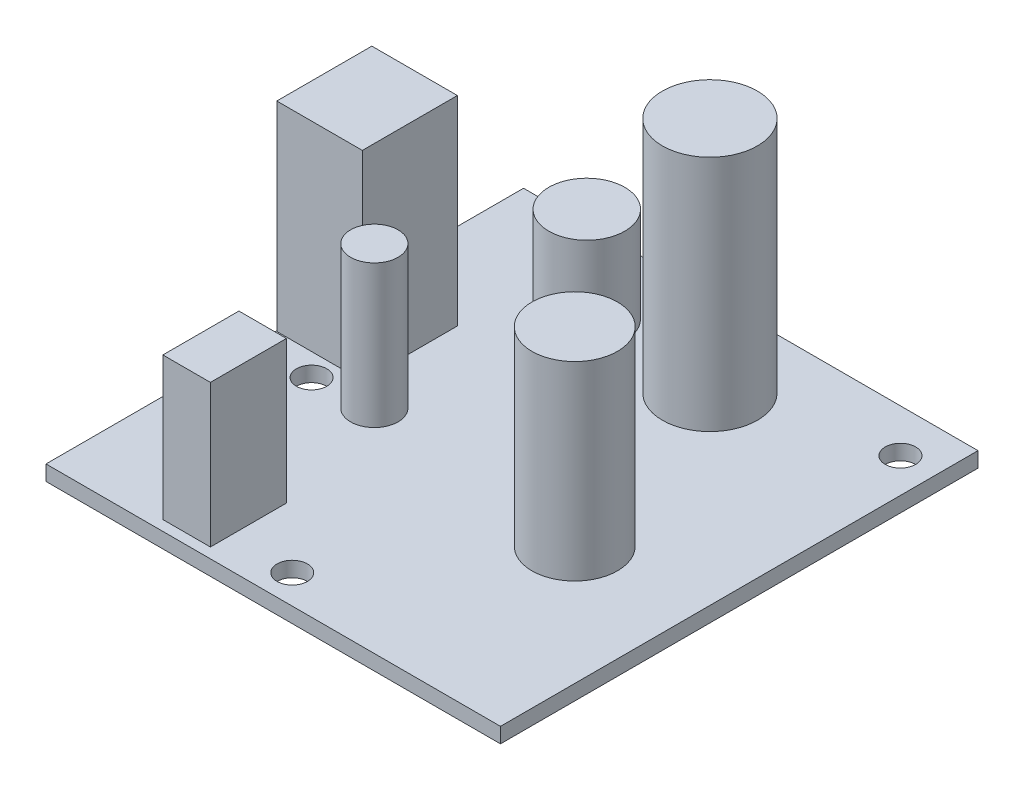
ISO-10303-21;
HEADER;
FILE_DESCRIPTION(('STEP AP214'),'2;1');
FILE_NAME('part.step','',(''),(''),'','','');
FILE_SCHEMA(('AUTOMOTIVE_DESIGN { 1 0 10303 214 1 1 1 1 }'));
ENDSEC;
DATA;
#1=APPLICATION_CONTEXT('core data for automotive mechanical design processes');
#2=APPLICATION_PROTOCOL_DEFINITION('international standard','automotive_design',2000,#1);
#3=PRODUCT_CONTEXT('',#1,'mechanical');
#4=PRODUCT('Part','Part','',(#3));
#5=PRODUCT_RELATED_PRODUCT_CATEGORY('part','',(#4));
#6=PRODUCT_DEFINITION_FORMATION('','',#4);
#7=PRODUCT_DEFINITION_CONTEXT('part definition',#1,'design');
#8=PRODUCT_DEFINITION('design','',#6,#7);
#9=PRODUCT_DEFINITION_SHAPE('','',#8);
#10=(LENGTH_UNIT() NAMED_UNIT(*) SI_UNIT(.MILLI.,.METRE.));
#11=(NAMED_UNIT(*) PLANE_ANGLE_UNIT() SI_UNIT($,.RADIAN.));
#12=(NAMED_UNIT(*) SI_UNIT($,.STERADIAN.) SOLID_ANGLE_UNIT());
#13=UNCERTAINTY_MEASURE_WITH_UNIT(LENGTH_MEASURE(1.E-05),#10,'distance_accuracy_value','');
#14=(GEOMETRIC_REPRESENTATION_CONTEXT(3) GLOBAL_UNCERTAINTY_ASSIGNED_CONTEXT((#13)) GLOBAL_UNIT_ASSIGNED_CONTEXT((#10,
#11,#12)) REPRESENTATION_CONTEXT('',''));
#15=CARTESIAN_POINT('',(0.,0.,0.));
#16=DIRECTION('',(0.,0.,1.));
#17=DIRECTION('',(1.,0.,0.));
#18=AXIS2_PLACEMENT_3D('',#15,#16,#17);
#19=CARTESIAN_POINT('',(15.24,10.,-41.656));
#20=DIRECTION('',(0.,-1.,0.));
#21=DIRECTION('',(0.,0.,-1.));
#22=AXIS2_PLACEMENT_3D('',#19,#20,#21);
#23=CYLINDRICAL_SURFACE('',#22,4.);
#24=CARTESIAN_POINT('',(15.24,10.,-41.656));
#25=DIRECTION('',(0.,1.,0.));
#26=DIRECTION('',(0.,0.,1.));
#27=AXIS2_PLACEMENT_3D('',#24,#25,#26);
#28=CIRCLE('',#27,4.);
#29=CARTESIAN_POINT('',(15.24,10.,-37.656));
#30=VERTEX_POINT('',#29);
#31=EDGE_CURVE('E11',#30,#30,#28,.T.);
#32=ORIENTED_EDGE('',*,*,#31,.F.);
#33=EDGE_LOOP('',(#32));
#34=FACE_BOUND('',#33,.T.);
#35=CARTESIAN_POINT('',(15.24,0.,-41.656));
#36=DIRECTION('',(0.,1.,0.));
#37=DIRECTION('',(0.,0.,1.));
#38=AXIS2_PLACEMENT_3D('',#35,#36,#37);
#39=CIRCLE('',#38,4.);
#40=CARTESIAN_POINT('',(15.24,0.,-37.656));
#41=VERTEX_POINT('',#40);
#42=EDGE_CURVE('E55',#41,#41,#39,.T.);
#43=ORIENTED_EDGE('',*,*,#42,.T.);
#44=EDGE_LOOP('',(#43));
#45=FACE_BOUND('',#44,.T.);
#46=ADVANCED_FACE('F52',(#34,#45),#23,.T.);
#47=CARTESIAN_POINT('',(0.,10.,0.));
#48=DIRECTION('',(0.,1.,0.));
#49=DIRECTION('',(0.,0.,1.));
#50=AXIS2_PLACEMENT_3D('',#47,#48,#49);
#51=PLANE('',#50);
#52=ORIENTED_EDGE('',*,*,#31,.T.);
#53=EDGE_LOOP('',(#52));
#54=FACE_BOUND('',#53,.T.);
#55=ADVANCED_FACE('F67',(#54),#51,.T.);
#56=CARTESIAN_POINT('',(0.,0.,0.));
#57=DIRECTION('',(0.,1.,0.));
#58=DIRECTION('',(0.,0.,1.));
#59=AXIS2_PLACEMENT_3D('',#56,#57,#58);
#60=PLANE('',#59);
#61=ORIENTED_EDGE('',*,*,#42,.F.);
#62=EDGE_LOOP('',(#61));
#63=FACE_BOUND('',#62,.T.);
#64=ADVANCED_FACE('F65',(#63),#60,.F.);
#65=CLOSED_SHELL('',(#46,#55,#64));
#66=MANIFOLD_SOLID_BREP('B2',#65);
#67=CARTESIAN_POINT('',(47.81426875,-1.6,-50.24035));
#68=DIRECTION('',(1.,0.,0.));
#69=DIRECTION('',(0.,0.,-1.));
#70=AXIS2_PLACEMENT_3D('',#67,#68,#69);
#71=PLANE('',#70);
#72=DIRECTION('',(0.,0.,-1.));
#73=VECTOR('',#72,1.);
#74=CARTESIAN_POINT('',(47.81426875,0.,-50.24035));
#75=LINE('',#74,#73);
#76=CARTESIAN_POINT('',(47.81426875,0.,0.));
#77=VERTEX_POINT('',#76);
#78=CARTESIAN_POINT('',(47.81426875,0.,-50.24035));
#79=VERTEX_POINT('',#78);
#80=EDGE_CURVE('E300',#77,#79,#75,.T.);
#81=ORIENTED_EDGE('',*,*,#80,.F.);
#82=DIRECTION('',(0.,1.,0.));
#83=VECTOR('',#82,1.);
#84=CARTESIAN_POINT('',(47.81426875,-1.6,0.));
#85=LINE('',#84,#83);
#86=CARTESIAN_POINT('',(47.81426875,-1.6,0.));
#87=VERTEX_POINT('',#86);
#88=EDGE_CURVE('E50',#87,#77,#85,.T.);
#89=ORIENTED_EDGE('',*,*,#88,.F.);
#90=DIRECTION('',(0.,0.,-1.));
#91=VECTOR('',#90,1.);
#92=CARTESIAN_POINT('',(47.81426875,-1.6,-50.24035));
#93=LINE('',#92,#91);
#94=CARTESIAN_POINT('',(47.81426875,-1.6,-50.24035));
#95=VERTEX_POINT('',#94);
#96=EDGE_CURVE('E304',#87,#95,#93,.T.);
#97=ORIENTED_EDGE('',*,*,#96,.T.);
#98=DIRECTION('',(0.,1.,0.));
#99=VECTOR('',#98,1.);
#100=CARTESIAN_POINT('',(47.81426875,-1.6,-50.24035));
#101=LINE('',#100,#99);
#102=EDGE_CURVE('E104',#95,#79,#101,.T.);
#103=ORIENTED_EDGE('',*,*,#102,.T.);
#104=EDGE_LOOP('',(#81,#89,#97,#103));
#105=FACE_BOUND('',#104,.T.);
#106=ADVANCED_FACE('F101',(#105),#71,.T.);
#107=CARTESIAN_POINT('',(47.81426875,-1.6,0.));
#108=DIRECTION('',(0.,0.,1.));
#109=DIRECTION('',(1.,0.,0.));
#110=AXIS2_PLACEMENT_3D('',#107,#108,#109);
#111=PLANE('',#110);
#112=DIRECTION('',(1.,0.,0.));
#113=VECTOR('',#112,1.);
#114=CARTESIAN_POINT('',(47.81426875,0.,0.));
#115=LINE('',#114,#113);
#116=CARTESIAN_POINT('',(0.,0.,0.));
#117=VERTEX_POINT('',#116);
#118=EDGE_CURVE('E309',#117,#77,#115,.T.);
#119=ORIENTED_EDGE('',*,*,#118,.F.);
#120=DIRECTION('',(0.,1.,0.));
#121=VECTOR('',#120,1.);
#122=CARTESIAN_POINT('',(0.,-1.6,0.));
#123=LINE('',#122,#121);
#124=CARTESIAN_POINT('',(0.,-1.6,0.));
#125=VERTEX_POINT('',#124);
#126=EDGE_CURVE('E110',#125,#117,#123,.T.);
#127=ORIENTED_EDGE('',*,*,#126,.F.);
#128=DIRECTION('',(1.,0.,0.));
#129=VECTOR('',#128,1.);
#130=CARTESIAN_POINT('',(47.81426875,-1.6,0.));
#131=LINE('',#130,#129);
#132=EDGE_CURVE('E317',#125,#87,#131,.T.);
#133=ORIENTED_EDGE('',*,*,#132,.T.);
#134=ORIENTED_EDGE('',*,*,#88,.T.);
#135=EDGE_LOOP('',(#119,#127,#133,#134));
#136=FACE_BOUND('',#135,.T.);
#137=ADVANCED_FACE('F351',(#136),#111,.T.);
#138=CARTESIAN_POINT('',(0.,-1.6,-50.24035));
#139=DIRECTION('',(-1.,0.,0.));
#140=DIRECTION('',(0.,0.,1.));
#141=AXIS2_PLACEMENT_3D('',#138,#139,#140);
#142=PLANE('',#141);
#143=DIRECTION('',(0.,0.,1.));
#144=VECTOR('',#143,1.);
#145=CARTESIAN_POINT('',(0.,0.,-50.24035));
#146=LINE('',#145,#144);
#147=CARTESIAN_POINT('',(0.,0.,-50.24035));
#148=VERTEX_POINT('',#147);
#149=EDGE_CURVE('E328',#148,#117,#146,.T.);
#150=ORIENTED_EDGE('',*,*,#149,.F.);
#151=DIRECTION('',(0.,1.,0.));
#152=VECTOR('',#151,1.);
#153=CARTESIAN_POINT('',(0.,-1.6,-50.24035));
#154=LINE('',#153,#152);
#155=CARTESIAN_POINT('',(0.,-1.6,-50.24035));
#156=VERTEX_POINT('',#155);
#157=EDGE_CURVE('E336',#156,#148,#154,.T.);
#158=ORIENTED_EDGE('',*,*,#157,.F.);
#159=DIRECTION('',(0.,0.,1.));
#160=VECTOR('',#159,1.);
#161=CARTESIAN_POINT('',(0.,-1.6,-50.24035));
#162=LINE('',#161,#160);
#163=EDGE_CURVE('E313',#156,#125,#162,.T.);
#164=ORIENTED_EDGE('',*,*,#163,.T.);
#165=ORIENTED_EDGE('',*,*,#126,.T.);
#166=EDGE_LOOP('',(#150,#158,#164,#165));
#167=FACE_BOUND('',#166,.T.);
#168=ADVANCED_FACE('F356',(#167),#142,.T.);
#169=CARTESIAN_POINT('',(47.81426875,-1.6,-50.24035));
#170=DIRECTION('',(0.,0.,-1.));
#171=DIRECTION('',(-1.,0.,0.));
#172=AXIS2_PLACEMENT_3D('',#169,#170,#171);
#173=PLANE('',#172);
#174=DIRECTION('',(-1.,0.,0.));
#175=VECTOR('',#174,1.);
#176=CARTESIAN_POINT('',(47.81426875,0.,-50.24035));
#177=LINE('',#176,#175);
#178=EDGE_CURVE('E324',#79,#148,#177,.T.);
#179=ORIENTED_EDGE('',*,*,#178,.F.);
#180=ORIENTED_EDGE('',*,*,#102,.F.);
#181=DIRECTION('',(-1.,0.,0.));
#182=VECTOR('',#181,1.);
#183=CARTESIAN_POINT('',(47.81426875,-1.6,-50.24035));
#184=LINE('',#183,#182);
#185=EDGE_CURVE('E308',#95,#156,#184,.T.);
#186=ORIENTED_EDGE('',*,*,#185,.T.);
#187=ORIENTED_EDGE('',*,*,#157,.T.);
#188=EDGE_LOOP('',(#179,#180,#186,#187));
#189=FACE_BOUND('',#188,.T.);
#190=ADVANCED_FACE('F346',(#189),#173,.T.);
#191=CARTESIAN_POINT('',(0.,-1.6,0.));
#192=DIRECTION('',(0.,-1.,0.));
#193=DIRECTION('',(0.,0.,-1.));
#194=AXIS2_PLACEMENT_3D('',#191,#192,#193);
#195=PLANE('',#194);
#196=CARTESIAN_POINT('',(22.86,-1.6,-3.04800000000001));
#197=DIRECTION('',(0.,1.,0.));
#198=DIRECTION('',(0.,0.,1.));
#199=AXIS2_PLACEMENT_3D('',#196,#197,#198);
#200=CIRCLE('',#199,1.6);
#201=CARTESIAN_POINT('',(22.86,-1.6,-1.448));
#202=VERTEX_POINT('',#201);
#203=EDGE_CURVE('E552',#202,#202,#200,.T.);
#204=ORIENTED_EDGE('',*,*,#203,.T.);
#205=EDGE_LOOP('',(#204));
#206=FACE_BOUND('',#205,.T.);
#207=CARTESIAN_POINT('',(44.196,-1.6,-45.7));
#208=DIRECTION('',(0.,1.,0.));
#209=DIRECTION('',(0.,0.,1.));
#210=AXIS2_PLACEMENT_3D('',#207,#208,#209);
#211=CIRCLE('',#210,1.6);
#212=CARTESIAN_POINT('',(44.196,-1.6,-44.1));
#213=VERTEX_POINT('',#212);
#214=EDGE_CURVE('E562',#213,#213,#211,.T.);
#215=ORIENTED_EDGE('',*,*,#214,.T.);
#216=EDGE_LOOP('',(#215));
#217=FACE_BOUND('',#216,.T.);
#218=CARTESIAN_POINT('',(6.096,-1.6,-21.844));
#219=DIRECTION('',(0.,1.,0.));
#220=DIRECTION('',(0.,0.,1.));
#221=AXIS2_PLACEMENT_3D('',#218,#219,#220);
#222=CIRCLE('',#221,1.6);
#223=CARTESIAN_POINT('',(6.096,-1.6,-20.244));
#224=VERTEX_POINT('',#223);
#225=EDGE_CURVE('E570',#224,#224,#222,.T.);
#226=ORIENTED_EDGE('',*,*,#225,.T.);
#227=EDGE_LOOP('',(#226));
#228=FACE_BOUND('',#227,.T.);
#229=CARTESIAN_POINT('',(15.24,-1.6,-41.656));
#230=DIRECTION('',(0.,1.,0.));
#231=DIRECTION('',(0.,0.,1.));
#232=AXIS2_PLACEMENT_3D('',#229,#230,#231);
#233=CIRCLE('',#232,4.);
#234=CARTESIAN_POINT('',(15.24,-1.6,-37.656));
#235=VERTEX_POINT('',#234);
#236=EDGE_CURVE('E578',#235,#235,#233,.T.);
#237=ORIENTED_EDGE('',*,*,#236,.T.);
#238=EDGE_LOOP('',(#237));
#239=FACE_BOUND('',#238,.T.);
#240=CARTESIAN_POINT('',(12.192,-1.6,-22.352));
#241=DIRECTION('',(0.,1.,0.));
#242=DIRECTION('',(0.,0.,1.));
#243=AXIS2_PLACEMENT_3D('',#240,#241,#242);
#244=CIRCLE('',#243,2.5);
#245=CARTESIAN_POINT('',(12.192,-1.6,-19.852));
#246=VERTEX_POINT('',#245);
#247=EDGE_CURVE('E229',#246,#246,#244,.T.);
#248=ORIENTED_EDGE('',*,*,#247,.T.);
#249=EDGE_LOOP('',(#248));
#250=FACE_BOUND('',#249,.T.);
#251=DIRECTION('',(0.,0.,-1.));
#252=VECTOR('',#251,1.);
#253=CARTESIAN_POINT('',(16.216,-1.6,-1.08));
#254=LINE('',#253,#252);
#255=CARTESIAN_POINT('',(16.216,-1.6,-1.08));
#256=VERTEX_POINT('',#255);
#257=CARTESIAN_POINT('',(16.216,-1.6,-9.08));
#258=VERTEX_POINT('',#257);
#259=EDGE_CURVE('E193',#256,#258,#254,.T.);
#260=ORIENTED_EDGE('',*,*,#259,.T.);
#261=DIRECTION('',(-1.,0.,0.));
#262=VECTOR('',#261,1.);
#263=CARTESIAN_POINT('',(11.216,-1.6,-9.08));
#264=LINE('',#263,#262);
#265=CARTESIAN_POINT('',(11.216,-1.6,-9.08));
#266=VERTEX_POINT('',#265);
#267=EDGE_CURVE('E203',#258,#266,#264,.T.);
#268=ORIENTED_EDGE('',*,*,#267,.T.);
#269=DIRECTION('',(0.,0.,1.));
#270=VECTOR('',#269,1.);
#271=CARTESIAN_POINT('',(11.216,-1.6,-1.08));
#272=LINE('',#271,#270);
#273=CARTESIAN_POINT('',(11.216,-1.6,-1.08));
#274=VERTEX_POINT('',#273);
#275=EDGE_CURVE('E118',#266,#274,#272,.T.);
#276=ORIENTED_EDGE('',*,*,#275,.T.);
#277=DIRECTION('',(1.,0.,0.));
#278=VECTOR('',#277,1.);
#279=CARTESIAN_POINT('',(11.216,-1.6,-1.08));
#280=LINE('',#279,#278);
#281=EDGE_CURVE('E200',#274,#256,#280,.T.);
#282=ORIENTED_EDGE('',*,*,#281,.T.);
#283=EDGE_LOOP('',(#260,#268,#276,#282));
#284=FACE_BOUND('',#283,.T.);
#285=CARTESIAN_POINT('',(35.306,-1.6,-20.32));
#286=DIRECTION('',(0.,1.,0.));
#287=DIRECTION('',(0.,0.,1.));
#288=AXIS2_PLACEMENT_3D('',#285,#286,#287);
#289=CIRCLE('',#288,4.5);
#290=CARTESIAN_POINT('',(35.306,-1.6,-15.82));
#291=VERTEX_POINT('',#290);
#292=EDGE_CURVE('E244',#291,#291,#289,.T.);
#293=ORIENTED_EDGE('',*,*,#292,.T.);
#294=EDGE_LOOP('',(#293));
#295=FACE_BOUND('',#294,.T.);
#296=DIRECTION('',(0.,0.,-1.));
#297=VECTOR('',#296,1.);
#298=CARTESIAN_POINT('',(9.07199999999998,-1.6,-34.21));
#299=LINE('',#298,#297);
#300=CARTESIAN_POINT('',(9.07199999999998,-1.6,-24.21));
#301=VERTEX_POINT('',#300);
#302=CARTESIAN_POINT('',(9.07199999999998,-1.6,-34.21));
#303=VERTEX_POINT('',#302);
#304=EDGE_CURVE('E252',#301,#303,#299,.T.);
#305=ORIENTED_EDGE('',*,*,#304,.T.);
#306=DIRECTION('',(-1.,0.,0.));
#307=VECTOR('',#306,1.);
#308=CARTESIAN_POINT('',(0.0719999999999818,-1.6,-34.21));
#309=LINE('',#308,#307);
#310=CARTESIAN_POINT('',(0.0719999999999818,-1.6,-34.21));
#311=VERTEX_POINT('',#310);
#312=EDGE_CURVE('E256',#303,#311,#309,.T.);
#313=ORIENTED_EDGE('',*,*,#312,.T.);
#314=DIRECTION('',(0.,0.,1.));
#315=VECTOR('',#314,1.);
#316=CARTESIAN_POINT('',(0.0719999999999818,-1.6,-34.21));
#317=LINE('',#316,#315);
#318=CARTESIAN_POINT('',(0.0719999999999818,-1.6,-24.21));
#319=VERTEX_POINT('',#318);
#320=EDGE_CURVE('E261',#311,#319,#317,.T.);
#321=ORIENTED_EDGE('',*,*,#320,.T.);
#322=DIRECTION('',(1.,0.,0.));
#323=VECTOR('',#322,1.);
#324=CARTESIAN_POINT('',(0.0719999999999818,-1.6,-24.21));
#325=LINE('',#324,#323);
#326=EDGE_CURVE('E265',#319,#301,#325,.T.);
#327=ORIENTED_EDGE('',*,*,#326,.T.);
#328=EDGE_LOOP('',(#305,#313,#321,#327));
#329=FACE_BOUND('',#328,.T.);
#330=CARTESIAN_POINT('',(28.448,-1.6,-41.402));
#331=DIRECTION('',(0.,1.,0.));
#332=DIRECTION('',(0.,0.,1.));
#333=AXIS2_PLACEMENT_3D('',#330,#331,#332);
#334=CIRCLE('',#333,5.00000000000001);
#335=CARTESIAN_POINT('',(28.448,-1.6,-36.402));
#336=VERTEX_POINT('',#335);
#337=EDGE_CURVE('E296',#336,#336,#334,.T.);
#338=ORIENTED_EDGE('',*,*,#337,.T.);
#339=EDGE_LOOP('',(#338));
#340=FACE_BOUND('',#339,.T.);
#341=ORIENTED_EDGE('',*,*,#96,.F.);
#342=ORIENTED_EDGE('',*,*,#132,.F.);
#343=ORIENTED_EDGE('',*,*,#163,.F.);
#344=ORIENTED_EDGE('',*,*,#185,.F.);
#345=EDGE_LOOP('',(#341,#342,#343,#344));
#346=FACE_BOUND('',#345,.T.);
#347=ADVANCED_FACE('F208',(#206,#217,#228,#239,#250,#284,#295,#329,#340,#346),#195,.T.);
#348=CARTESIAN_POINT('',(0.,0.,0.));
#349=DIRECTION('',(0.,-1.,0.));
#350=DIRECTION('',(0.,0.,-1.));
#351=AXIS2_PLACEMENT_3D('',#348,#349,#350);
#352=PLANE('',#351);
#353=CARTESIAN_POINT('',(22.86,0.,-3.04800000000001));
#354=DIRECTION('',(0.,1.,0.));
#355=DIRECTION('',(0.,0.,1.));
#356=AXIS2_PLACEMENT_3D('',#353,#354,#355);
#357=CIRCLE('',#356,1.6);
#358=CARTESIAN_POINT('',(22.86,0.,-1.448));
#359=VERTEX_POINT('',#358);
#360=EDGE_CURVE('E555',#359,#359,#357,.T.);
#361=ORIENTED_EDGE('',*,*,#360,.F.);
#362=EDGE_LOOP('',(#361));
#363=FACE_BOUND('',#362,.T.);
#364=CARTESIAN_POINT('',(44.196,0.,-45.7));
#365=DIRECTION('',(0.,1.,0.));
#366=DIRECTION('',(0.,0.,1.));
#367=AXIS2_PLACEMENT_3D('',#364,#365,#366);
#368=CIRCLE('',#367,1.6);
#369=CARTESIAN_POINT('',(44.196,0.,-44.1));
#370=VERTEX_POINT('',#369);
#371=EDGE_CURVE('E559',#370,#370,#368,.T.);
#372=ORIENTED_EDGE('',*,*,#371,.F.);
#373=EDGE_LOOP('',(#372));
#374=FACE_BOUND('',#373,.T.);
#375=CARTESIAN_POINT('',(6.096,0.,-21.844));
#376=DIRECTION('',(0.,1.,0.));
#377=DIRECTION('',(0.,0.,1.));
#378=AXIS2_PLACEMENT_3D('',#375,#376,#377);
#379=CIRCLE('',#378,1.6);
#380=CARTESIAN_POINT('',(6.096,0.,-20.244));
#381=VERTEX_POINT('',#380);
#382=EDGE_CURVE('E566',#381,#381,#379,.T.);
#383=ORIENTED_EDGE('',*,*,#382,.F.);
#384=EDGE_LOOP('',(#383));
#385=FACE_BOUND('',#384,.T.);
#386=CARTESIAN_POINT('',(15.24,0.,-41.656));
#387=DIRECTION('',(0.,1.,0.));
#388=DIRECTION('',(0.,0.,1.));
#389=AXIS2_PLACEMENT_3D('',#386,#387,#388);
#390=CIRCLE('',#389,4.);
#391=CARTESIAN_POINT('',(15.24,0.,-37.656));
#392=VERTEX_POINT('',#391);
#393=EDGE_CURVE('E574',#392,#392,#390,.T.);
#394=ORIENTED_EDGE('',*,*,#393,.F.);
#395=EDGE_LOOP('',(#394));
#396=FACE_BOUND('',#395,.T.);
#397=CARTESIAN_POINT('',(12.192,0.,-22.352));
#398=DIRECTION('',(0.,1.,0.));
#399=DIRECTION('',(0.,0.,1.));
#400=AXIS2_PLACEMENT_3D('',#397,#398,#399);
#401=CIRCLE('',#400,2.5);
#402=CARTESIAN_POINT('',(12.192,0.,-19.852));
#403=VERTEX_POINT('',#402);
#404=EDGE_CURVE('E219',#403,#403,#401,.T.);
#405=ORIENTED_EDGE('',*,*,#404,.F.);
#406=EDGE_LOOP('',(#405));
#407=FACE_BOUND('',#406,.T.);
#408=DIRECTION('',(-1.,0.,0.));
#409=VECTOR('',#408,1.);
#410=CARTESIAN_POINT('',(11.216,0.,-9.08));
#411=LINE('',#410,#409);
#412=CARTESIAN_POINT('',(16.216,0.,-9.08));
#413=VERTEX_POINT('',#412);
#414=CARTESIAN_POINT('',(11.216,0.,-9.08));
#415=VERTEX_POINT('',#414);
#416=EDGE_CURVE('E228',#413,#415,#411,.T.);
#417=ORIENTED_EDGE('',*,*,#416,.F.);
#418=DIRECTION('',(0.,0.,-1.));
#419=VECTOR('',#418,1.);
#420=CARTESIAN_POINT('',(16.216,0.,-1.08));
#421=LINE('',#420,#419);
#422=CARTESIAN_POINT('',(16.216,0.,-1.08));
#423=VERTEX_POINT('',#422);
#424=EDGE_CURVE('E126',#423,#413,#421,.T.);
#425=ORIENTED_EDGE('',*,*,#424,.F.);
#426=DIRECTION('',(1.,0.,0.));
#427=VECTOR('',#426,1.);
#428=CARTESIAN_POINT('',(11.216,0.,-1.08));
#429=LINE('',#428,#427);
#430=CARTESIAN_POINT('',(11.216,0.,-1.08));
#431=VERTEX_POINT('',#430);
#432=EDGE_CURVE('E212',#431,#423,#429,.T.);
#433=ORIENTED_EDGE('',*,*,#432,.F.);
#434=DIRECTION('',(0.,0.,1.));
#435=VECTOR('',#434,1.);
#436=CARTESIAN_POINT('',(11.216,0.,-1.08));
#437=LINE('',#436,#435);
#438=EDGE_CURVE('E216',#415,#431,#437,.T.);
#439=ORIENTED_EDGE('',*,*,#438,.F.);
#440=EDGE_LOOP('',(#417,#425,#433,#439));
#441=FACE_BOUND('',#440,.T.);
#442=CARTESIAN_POINT('',(35.306,0.,-20.32));
#443=DIRECTION('',(0.,1.,0.));
#444=DIRECTION('',(0.,0.,1.));
#445=AXIS2_PLACEMENT_3D('',#442,#443,#444);
#446=CIRCLE('',#445,4.5);
#447=CARTESIAN_POINT('',(35.306,0.,-15.82));
#448=VERTEX_POINT('',#447);
#449=EDGE_CURVE('E238',#448,#448,#446,.T.);
#450=ORIENTED_EDGE('',*,*,#449,.F.);
#451=EDGE_LOOP('',(#450));
#452=FACE_BOUND('',#451,.T.);
#453=DIRECTION('',(-1.,0.,0.));
#454=VECTOR('',#453,1.);
#455=CARTESIAN_POINT('',(0.0719999999999818,0.,-34.21));
#456=LINE('',#455,#454);
#457=CARTESIAN_POINT('',(9.07199999999998,0.,-34.21));
#458=VERTEX_POINT('',#457);
#459=CARTESIAN_POINT('',(0.0719999999999818,0.,-34.21));
#460=VERTEX_POINT('',#459);
#461=EDGE_CURVE('E272',#458,#460,#456,.T.);
#462=ORIENTED_EDGE('',*,*,#461,.F.);
#463=DIRECTION('',(0.,0.,-1.));
#464=VECTOR('',#463,1.);
#465=CARTESIAN_POINT('',(9.07199999999998,0.,-34.21));
#466=LINE('',#465,#464);
#467=CARTESIAN_POINT('',(9.07199999999998,0.,-24.21));
#468=VERTEX_POINT('',#467);
#469=EDGE_CURVE('E248',#468,#458,#466,.T.);
#470=ORIENTED_EDGE('',*,*,#469,.F.);
#471=DIRECTION('',(1.,0.,0.));
#472=VECTOR('',#471,1.);
#473=CARTESIAN_POINT('',(0.0719999999999818,0.,-24.21));
#474=LINE('',#473,#472);
#475=CARTESIAN_POINT('',(0.0719999999999818,0.,-24.21));
#476=VERTEX_POINT('',#475);
#477=EDGE_CURVE('E257',#476,#468,#474,.T.);
#478=ORIENTED_EDGE('',*,*,#477,.F.);
#479=DIRECTION('',(0.,0.,1.));
#480=VECTOR('',#479,1.);
#481=CARTESIAN_POINT('',(0.0719999999999818,0.,-34.21));
#482=LINE('',#481,#480);
#483=EDGE_CURVE('E276',#460,#476,#482,.T.);
#484=ORIENTED_EDGE('',*,*,#483,.F.);
#485=EDGE_LOOP('',(#462,#470,#478,#484));
#486=FACE_BOUND('',#485,.T.);
#487=CARTESIAN_POINT('',(28.448,0.,-41.402));
#488=DIRECTION('',(0.,1.,0.));
#489=DIRECTION('',(0.,0.,1.));
#490=AXIS2_PLACEMENT_3D('',#487,#488,#489);
#491=CIRCLE('',#490,5.00000000000001);
#492=CARTESIAN_POINT('',(28.448,0.,-36.402));
#493=VERTEX_POINT('',#492);
#494=EDGE_CURVE('E286',#493,#493,#491,.T.);
#495=ORIENTED_EDGE('',*,*,#494,.F.);
#496=EDGE_LOOP('',(#495));
#497=FACE_BOUND('',#496,.T.);
#498=ORIENTED_EDGE('',*,*,#80,.T.);
#499=ORIENTED_EDGE('',*,*,#178,.T.);
#500=ORIENTED_EDGE('',*,*,#149,.T.);
#501=ORIENTED_EDGE('',*,*,#118,.T.);
#502=EDGE_LOOP('',(#498,#499,#500,#501));
#503=FACE_BOUND('',#502,.T.);
#504=ADVANCED_FACE('F348',(#363,#374,#385,#396,#407,#441,#452,#486,#497,#503),#352,.F.);
#505=CARTESIAN_POINT('',(28.448,-1.6,-41.402));
#506=DIRECTION('',(0.,1.,0.));
#507=DIRECTION('',(0.,0.,1.));
#508=AXIS2_PLACEMENT_3D('',#505,#506,#507);
#509=CYLINDRICAL_SURFACE('',#508,5.00000000000001);
#510=ORIENTED_EDGE('',*,*,#337,.F.);
#511=EDGE_LOOP('',(#510));
#512=FACE_BOUND('',#511,.T.);
#513=ORIENTED_EDGE('',*,*,#494,.T.);
#514=EDGE_LOOP('',(#513));
#515=FACE_BOUND('',#514,.T.);
#516=ADVANCED_FACE('F400',(#512,#515),#509,.F.);
#517=CARTESIAN_POINT('',(9.07199999999998,-1.6,-34.21));
#518=DIRECTION('',(1.,0.,0.));
#519=DIRECTION('',(0.,0.,-1.));
#520=AXIS2_PLACEMENT_3D('',#517,#518,#519);
#521=PLANE('',#520);
#522=ORIENTED_EDGE('',*,*,#469,.T.);
#523=DIRECTION('',(0.,1.,0.));
#524=VECTOR('',#523,1.);
#525=CARTESIAN_POINT('',(9.07199999999998,-1.6,-34.21));
#526=LINE('',#525,#524);
#527=EDGE_CURVE('E269',#303,#458,#526,.T.);
#528=ORIENTED_EDGE('',*,*,#527,.F.);
#529=ORIENTED_EDGE('',*,*,#304,.F.);
#530=DIRECTION('',(0.,1.,0.));
#531=VECTOR('',#530,1.);
#532=CARTESIAN_POINT('',(9.07199999999998,-1.6,-24.21));
#533=LINE('',#532,#531);
#534=EDGE_CURVE('E283',#301,#468,#533,.T.);
#535=ORIENTED_EDGE('',*,*,#534,.T.);
#536=EDGE_LOOP('',(#522,#528,#529,#535));
#537=FACE_BOUND('',#536,.T.);
#538=ADVANCED_FACE('F410',(#537),#521,.F.);
#539=CARTESIAN_POINT('',(0.0719999999999818,-1.6,-24.21));
#540=DIRECTION('',(0.,0.,1.));
#541=DIRECTION('',(1.,0.,0.));
#542=AXIS2_PLACEMENT_3D('',#539,#540,#541);
#543=PLANE('',#542);
#544=ORIENTED_EDGE('',*,*,#477,.T.);
#545=ORIENTED_EDGE('',*,*,#534,.F.);
#546=ORIENTED_EDGE('',*,*,#326,.F.);
#547=DIRECTION('',(0.,1.,0.));
#548=VECTOR('',#547,1.);
#549=CARTESIAN_POINT('',(0.0719999999999818,-1.6,-24.21));
#550=LINE('',#549,#548);
#551=EDGE_CURVE('E287',#319,#476,#550,.T.);
#552=ORIENTED_EDGE('',*,*,#551,.T.);
#553=EDGE_LOOP('',(#544,#545,#546,#552));
#554=FACE_BOUND('',#553,.T.);
#555=ADVANCED_FACE('F420',(#554),#543,.F.);
#556=CARTESIAN_POINT('',(0.0719999999999818,-1.6,-34.21));
#557=DIRECTION('',(-1.,0.,0.));
#558=DIRECTION('',(0.,0.,1.));
#559=AXIS2_PLACEMENT_3D('',#556,#557,#558);
#560=PLANE('',#559);
#561=ORIENTED_EDGE('',*,*,#483,.T.);
#562=ORIENTED_EDGE('',*,*,#551,.F.);
#563=ORIENTED_EDGE('',*,*,#320,.F.);
#564=DIRECTION('',(0.,1.,0.));
#565=VECTOR('',#564,1.);
#566=CARTESIAN_POINT('',(0.0719999999999818,-1.6,-34.21));
#567=LINE('',#566,#565);
#568=EDGE_CURVE('E290',#311,#460,#567,.T.);
#569=ORIENTED_EDGE('',*,*,#568,.T.);
#570=EDGE_LOOP('',(#561,#562,#563,#569));
#571=FACE_BOUND('',#570,.T.);
#572=ADVANCED_FACE('F430',(#571),#560,.F.);
#573=CARTESIAN_POINT('',(0.0719999999999818,-1.6,-34.21));
#574=DIRECTION('',(0.,0.,-1.));
#575=DIRECTION('',(-1.,0.,0.));
#576=AXIS2_PLACEMENT_3D('',#573,#574,#575);
#577=PLANE('',#576);
#578=ORIENTED_EDGE('',*,*,#461,.T.);
#579=ORIENTED_EDGE('',*,*,#568,.F.);
#580=ORIENTED_EDGE('',*,*,#312,.F.);
#581=ORIENTED_EDGE('',*,*,#527,.T.);
#582=EDGE_LOOP('',(#578,#579,#580,#581));
#583=FACE_BOUND('',#582,.T.);
#584=ADVANCED_FACE('F440',(#583),#577,.F.);
#585=CARTESIAN_POINT('',(35.306,-1.6,-20.32));
#586=DIRECTION('',(0.,1.,0.));
#587=DIRECTION('',(0.,0.,1.));
#588=AXIS2_PLACEMENT_3D('',#585,#586,#587);
#589=CYLINDRICAL_SURFACE('',#588,4.5);
#590=ORIENTED_EDGE('',*,*,#292,.F.);
#591=EDGE_LOOP('',(#590));
#592=FACE_BOUND('',#591,.T.);
#593=ORIENTED_EDGE('',*,*,#449,.T.);
#594=EDGE_LOOP('',(#593));
#595=FACE_BOUND('',#594,.T.);
#596=ADVANCED_FACE('F450',(#592,#595),#589,.F.);
#597=CARTESIAN_POINT('',(16.216,-1.6,-1.08));
#598=DIRECTION('',(1.,0.,0.));
#599=DIRECTION('',(0.,0.,-1.));
#600=AXIS2_PLACEMENT_3D('',#597,#598,#599);
#601=PLANE('',#600);
#602=ORIENTED_EDGE('',*,*,#424,.T.);
#603=DIRECTION('',(0.,1.,0.));
#604=VECTOR('',#603,1.);
#605=CARTESIAN_POINT('',(16.216,-1.6,-9.08));
#606=LINE('',#605,#604);
#607=EDGE_CURVE('E189',#258,#413,#606,.T.);
#608=ORIENTED_EDGE('',*,*,#607,.F.);
#609=ORIENTED_EDGE('',*,*,#259,.F.);
#610=DIRECTION('',(0.,1.,0.));
#611=VECTOR('',#610,1.);
#612=CARTESIAN_POINT('',(16.216,-1.6,-1.08));
#613=LINE('',#612,#611);
#614=EDGE_CURVE('E235',#256,#423,#613,.T.);
#615=ORIENTED_EDGE('',*,*,#614,.T.);
#616=EDGE_LOOP('',(#602,#608,#609,#615));
#617=FACE_BOUND('',#616,.T.);
#618=ADVANCED_FACE('F191',(#617),#601,.F.);
#619=CARTESIAN_POINT('',(11.216,-1.6,-1.08));
#620=DIRECTION('',(0.,0.,1.));
#621=DIRECTION('',(1.,0.,0.));
#622=AXIS2_PLACEMENT_3D('',#619,#620,#621);
#623=PLANE('',#622);
#624=ORIENTED_EDGE('',*,*,#432,.T.);
#625=ORIENTED_EDGE('',*,*,#614,.F.);
#626=ORIENTED_EDGE('',*,*,#281,.F.);
#627=DIRECTION('',(0.,1.,0.));
#628=VECTOR('',#627,1.);
#629=CARTESIAN_POINT('',(11.216,-1.6,-1.08));
#630=LINE('',#629,#628);
#631=EDGE_CURVE('E239',#274,#431,#630,.T.);
#632=ORIENTED_EDGE('',*,*,#631,.T.);
#633=EDGE_LOOP('',(#624,#625,#626,#632));
#634=FACE_BOUND('',#633,.T.);
#635=ADVANCED_FACE('F469',(#634),#623,.F.);
#636=CARTESIAN_POINT('',(11.216,-1.6,-1.08));
#637=DIRECTION('',(-1.,0.,0.));
#638=DIRECTION('',(0.,0.,1.));
#639=AXIS2_PLACEMENT_3D('',#636,#637,#638);
#640=PLANE('',#639);
#641=ORIENTED_EDGE('',*,*,#438,.T.);
#642=ORIENTED_EDGE('',*,*,#631,.F.);
#643=ORIENTED_EDGE('',*,*,#275,.F.);
#644=DIRECTION('',(0.,1.,0.));
#645=VECTOR('',#644,1.);
#646=CARTESIAN_POINT('',(11.216,-1.6,-9.08));
#647=LINE('',#646,#645);
#648=EDGE_CURVE('E199',#266,#415,#647,.T.);
#649=ORIENTED_EDGE('',*,*,#648,.T.);
#650=EDGE_LOOP('',(#641,#642,#643,#649));
#651=FACE_BOUND('',#650,.T.);
#652=ADVANCED_FACE('F478',(#651),#640,.F.);
#653=CARTESIAN_POINT('',(11.216,-1.6,-9.08));
#654=DIRECTION('',(0.,0.,-1.));
#655=DIRECTION('',(-1.,0.,0.));
#656=AXIS2_PLACEMENT_3D('',#653,#654,#655);
#657=PLANE('',#656);
#658=ORIENTED_EDGE('',*,*,#416,.T.);
#659=ORIENTED_EDGE('',*,*,#648,.F.);
#660=ORIENTED_EDGE('',*,*,#267,.F.);
#661=ORIENTED_EDGE('',*,*,#607,.T.);
#662=EDGE_LOOP('',(#658,#659,#660,#661));
#663=FACE_BOUND('',#662,.T.);
#664=ADVANCED_FACE('F204',(#663),#657,.F.);
#665=CARTESIAN_POINT('',(12.192,-1.6,-22.352));
#666=DIRECTION('',(0.,1.,0.));
#667=DIRECTION('',(0.,0.,1.));
#668=AXIS2_PLACEMENT_3D('',#665,#666,#667);
#669=CYLINDRICAL_SURFACE('',#668,2.5);
#670=ORIENTED_EDGE('',*,*,#247,.F.);
#671=EDGE_LOOP('',(#670));
#672=FACE_BOUND('',#671,.T.);
#673=ORIENTED_EDGE('',*,*,#404,.T.);
#674=EDGE_LOOP('',(#673));
#675=FACE_BOUND('',#674,.T.);
#676=ADVANCED_FACE('F496',(#672,#675),#669,.F.);
#677=CARTESIAN_POINT('',(15.24,-1.6,-41.656));
#678=DIRECTION('',(0.,1.,0.));
#679=DIRECTION('',(0.,0.,1.));
#680=AXIS2_PLACEMENT_3D('',#677,#678,#679);
#681=CYLINDRICAL_SURFACE('',#680,4.);
#682=ORIENTED_EDGE('',*,*,#236,.F.);
#683=EDGE_LOOP('',(#682));
#684=FACE_BOUND('',#683,.T.);
#685=ORIENTED_EDGE('',*,*,#393,.T.);
#686=EDGE_LOOP('',(#685));
#687=FACE_BOUND('',#686,.T.);
#688=ADVANCED_FACE('F505',(#684,#687),#681,.F.);
#689=CARTESIAN_POINT('',(6.096,-1.6,-21.844));
#690=DIRECTION('',(0.,1.,0.));
#691=DIRECTION('',(0.,0.,1.));
#692=AXIS2_PLACEMENT_3D('',#689,#690,#691);
#693=CYLINDRICAL_SURFACE('',#692,1.6);
#694=ORIENTED_EDGE('',*,*,#225,.F.);
#695=EDGE_LOOP('',(#694));
#696=FACE_BOUND('',#695,.T.);
#697=ORIENTED_EDGE('',*,*,#382,.T.);
#698=EDGE_LOOP('',(#697));
#699=FACE_BOUND('',#698,.T.);
#700=ADVANCED_FACE('F515',(#696,#699),#693,.F.);
#701=CARTESIAN_POINT('',(44.196,-1.6,-45.7));
#702=DIRECTION('',(0.,1.,0.));
#703=DIRECTION('',(0.,0.,1.));
#704=AXIS2_PLACEMENT_3D('',#701,#702,#703);
#705=CYLINDRICAL_SURFACE('',#704,1.6);
#706=ORIENTED_EDGE('',*,*,#214,.F.);
#707=EDGE_LOOP('',(#706));
#708=FACE_BOUND('',#707,.T.);
#709=ORIENTED_EDGE('',*,*,#371,.T.);
#710=EDGE_LOOP('',(#709));
#711=FACE_BOUND('',#710,.T.);
#712=ADVANCED_FACE('F525',(#708,#711),#705,.F.);
#713=CARTESIAN_POINT('',(22.86,-1.6,-3.04800000000001));
#714=DIRECTION('',(0.,1.,0.));
#715=DIRECTION('',(0.,0.,1.));
#716=AXIS2_PLACEMENT_3D('',#713,#714,#715);
#717=CYLINDRICAL_SURFACE('',#716,1.6);
#718=ORIENTED_EDGE('',*,*,#203,.F.);
#719=EDGE_LOOP('',(#718));
#720=FACE_BOUND('',#719,.T.);
#721=ORIENTED_EDGE('',*,*,#360,.T.);
#722=EDGE_LOOP('',(#721));
#723=FACE_BOUND('',#722,.T.);
#724=ADVANCED_FACE('F535',(#720,#723),#717,.F.);
#725=CLOSED_SHELL('',(#106,#137,#168,#190,#347,#504,#516,#538,#555,#572,#584,#596,#618,#635,
#652,#664,#676,#688,#700,#712,#724));
#726=MANIFOLD_SOLID_BREP('B6',#725);
#727=CARTESIAN_POINT('',(12.192,15.,-22.352));
#728=DIRECTION('',(0.,-1.,0.));
#729=DIRECTION('',(0.,0.,-1.));
#730=AXIS2_PLACEMENT_3D('',#727,#728,#729);
#731=CYLINDRICAL_SURFACE('',#730,2.5);
#732=CARTESIAN_POINT('',(12.192,15.,-22.352));
#733=DIRECTION('',(0.,1.,0.));
#734=DIRECTION('',(0.,0.,1.));
#735=AXIS2_PLACEMENT_3D('',#732,#733,#734);
#736=CIRCLE('',#735,2.5);
#737=CARTESIAN_POINT('',(12.192,15.,-19.852));
#738=VERTEX_POINT('',#737);
#739=EDGE_CURVE('E100',#738,#738,#736,.T.);
#740=ORIENTED_EDGE('',*,*,#739,.F.);
#741=EDGE_LOOP('',(#740));
#742=FACE_BOUND('',#741,.T.);
#743=CARTESIAN_POINT('',(12.192,0.,-22.352));
#744=DIRECTION('',(0.,1.,0.));
#745=DIRECTION('',(0.,0.,1.));
#746=AXIS2_PLACEMENT_3D('',#743,#744,#745);
#747=CIRCLE('',#746,2.5);
#748=CARTESIAN_POINT('',(12.192,0.,-19.852));
#749=VERTEX_POINT('',#748);
#750=EDGE_CURVE('E649',#749,#749,#747,.T.);
#751=ORIENTED_EDGE('',*,*,#750,.T.);
#752=EDGE_LOOP('',(#751));
#753=FACE_BOUND('',#752,.T.);
#754=ADVANCED_FACE('F646',(#742,#753),#731,.T.);
#755=CARTESIAN_POINT('',(0.,15.,0.));
#756=DIRECTION('',(0.,1.,0.));
#757=DIRECTION('',(0.,0.,1.));
#758=AXIS2_PLACEMENT_3D('',#755,#756,#757);
#759=PLANE('',#758);
#760=ORIENTED_EDGE('',*,*,#739,.T.);
#761=EDGE_LOOP('',(#760));
#762=FACE_BOUND('',#761,.T.);
#763=ADVANCED_FACE('F661',(#762),#759,.T.);
#764=CARTESIAN_POINT('',(0.,0.,0.));
#765=DIRECTION('',(0.,1.,0.));
#766=DIRECTION('',(0.,0.,1.));
#767=AXIS2_PLACEMENT_3D('',#764,#765,#766);
#768=PLANE('',#767);
#769=ORIENTED_EDGE('',*,*,#750,.F.);
#770=EDGE_LOOP('',(#769));
#771=FACE_BOUND('',#770,.T.);
#772=ADVANCED_FACE('F659',(#771),#768,.F.);
#773=CLOSED_SHELL('',(#754,#763,#772));
#774=MANIFOLD_SOLID_BREP('B44',#773);
#775=CARTESIAN_POINT('',(0.,15.,-1.08));
#776=DIRECTION('',(0.,0.,-1.));
#777=DIRECTION('',(-1.,0.,0.));
#778=AXIS2_PLACEMENT_3D('',#775,#776,#777);
#779=PLANE('',#778);
#780=DIRECTION('',(1.,0.,0.));
#781=VECTOR('',#780,1.);
#782=CARTESIAN_POINT('',(0.,0.,-1.08));
#783=LINE('',#782,#781);
#784=CARTESIAN_POINT('',(11.216,0.,-1.08));
#785=VERTEX_POINT('',#784);
#786=CARTESIAN_POINT('',(16.216,0.,-1.08));
#787=VERTEX_POINT('',#786);
#788=EDGE_CURVE('E758',#785,#787,#783,.T.);
#789=ORIENTED_EDGE('',*,*,#788,.T.);
#790=DIRECTION('',(0.,-1.,0.));
#791=VECTOR('',#790,1.);
#792=CARTESIAN_POINT('',(16.216,15.,-1.08));
#793=LINE('',#792,#791);
#794=CARTESIAN_POINT('',(16.216,15.,-1.08));
#795=VERTEX_POINT('',#794);
#796=EDGE_CURVE('E644',#795,#787,#793,.T.);
#797=ORIENTED_EDGE('',*,*,#796,.F.);
#798=DIRECTION('',(1.,0.,0.));
#799=VECTOR('',#798,1.);
#800=CARTESIAN_POINT('',(0.,15.,-1.08));
#801=LINE('',#800,#799);
#802=CARTESIAN_POINT('',(11.216,15.,-1.08));
#803=VERTEX_POINT('',#802);
#804=EDGE_CURVE('E744',#803,#795,#801,.T.);
#805=ORIENTED_EDGE('',*,*,#804,.F.);
#806=DIRECTION('',(0.,-1.,0.));
#807=VECTOR('',#806,1.);
#808=CARTESIAN_POINT('',(11.216,15.,-1.08));
#809=LINE('',#808,#807);
#810=EDGE_CURVE('E711',#803,#785,#809,.T.);
#811=ORIENTED_EDGE('',*,*,#810,.T.);
#812=EDGE_LOOP('',(#789,#797,#805,#811));
#813=FACE_BOUND('',#812,.T.);
#814=ADVANCED_FACE('F695',(#813),#779,.F.);
#815=CARTESIAN_POINT('',(16.216,15.,0.));
#816=DIRECTION('',(-1.,0.,0.));
#817=DIRECTION('',(0.,0.,1.));
#818=AXIS2_PLACEMENT_3D('',#815,#816,#817);
#819=PLANE('',#818);
#820=DIRECTION('',(0.,0.,-1.));
#821=VECTOR('',#820,1.);
#822=CARTESIAN_POINT('',(16.216,0.,0.));
#823=LINE('',#822,#821);
#824=CARTESIAN_POINT('',(16.216,0.,-9.08));
#825=VERTEX_POINT('',#824);
#826=EDGE_CURVE('E749',#787,#825,#823,.T.);
#827=ORIENTED_EDGE('',*,*,#826,.T.);
#828=DIRECTION('',(0.,-1.,0.));
#829=VECTOR('',#828,1.);
#830=CARTESIAN_POINT('',(16.216,15.,-9.08));
#831=LINE('',#830,#829);
#832=CARTESIAN_POINT('',(16.216,15.,-9.08));
#833=VERTEX_POINT('',#832);
#834=EDGE_CURVE('E703',#833,#825,#831,.T.);
#835=ORIENTED_EDGE('',*,*,#834,.F.);
#836=DIRECTION('',(0.,0.,-1.));
#837=VECTOR('',#836,1.);
#838=CARTESIAN_POINT('',(16.216,15.,0.));
#839=LINE('',#838,#837);
#840=EDGE_CURVE('E736',#795,#833,#839,.T.);
#841=ORIENTED_EDGE('',*,*,#840,.F.);
#842=ORIENTED_EDGE('',*,*,#796,.T.);
#843=EDGE_LOOP('',(#827,#835,#841,#842));
#844=FACE_BOUND('',#843,.T.);
#845=ADVANCED_FACE('F748',(#844),#819,.F.);
#846=CARTESIAN_POINT('',(0.,15.,-9.08));
#847=DIRECTION('',(0.,0.,-1.));
#848=DIRECTION('',(-1.,0.,0.));
#849=AXIS2_PLACEMENT_3D('',#846,#847,#848);
#850=PLANE('',#849);
#851=DIRECTION('',(1.,0.,0.));
#852=VECTOR('',#851,1.);
#853=CARTESIAN_POINT('',(0.,0.,-9.08));
#854=LINE('',#853,#852);
#855=CARTESIAN_POINT('',(11.216,0.,-9.08));
#856=VERTEX_POINT('',#855);
#857=EDGE_CURVE('E761',#856,#825,#854,.T.);
#858=ORIENTED_EDGE('',*,*,#857,.F.);
#859=DIRECTION('',(0.,-1.,0.));
#860=VECTOR('',#859,1.);
#861=CARTESIAN_POINT('',(11.216,15.,-9.08));
#862=LINE('',#861,#860);
#863=CARTESIAN_POINT('',(11.216,15.,-9.08));
#864=VERTEX_POINT('',#863);
#865=EDGE_CURVE('E725',#864,#856,#862,.T.);
#866=ORIENTED_EDGE('',*,*,#865,.F.);
#867=DIRECTION('',(1.,0.,0.));
#868=VECTOR('',#867,1.);
#869=CARTESIAN_POINT('',(0.,15.,-9.08));
#870=LINE('',#869,#868);
#871=EDGE_CURVE('E743',#864,#833,#870,.T.);
#872=ORIENTED_EDGE('',*,*,#871,.T.);
#873=ORIENTED_EDGE('',*,*,#834,.T.);
#874=EDGE_LOOP('',(#858,#866,#872,#873));
#875=FACE_BOUND('',#874,.T.);
#876=ADVANCED_FACE('F752',(#875),#850,.T.);
#877=CARTESIAN_POINT('',(11.216,15.,0.));
#878=DIRECTION('',(-1.,0.,0.));
#879=DIRECTION('',(0.,0.,1.));
#880=AXIS2_PLACEMENT_3D('',#877,#878,#879);
#881=PLANE('',#880);
#882=DIRECTION('',(0.,0.,-1.));
#883=VECTOR('',#882,1.);
#884=CARTESIAN_POINT('',(11.216,0.,0.));
#885=LINE('',#884,#883);
#886=EDGE_CURVE('E763',#785,#856,#885,.T.);
#887=ORIENTED_EDGE('',*,*,#886,.F.);
#888=ORIENTED_EDGE('',*,*,#810,.F.);
#889=DIRECTION('',(0.,0.,-1.));
#890=VECTOR('',#889,1.);
#891=CARTESIAN_POINT('',(11.216,15.,0.));
#892=LINE('',#891,#890);
#893=EDGE_CURVE('E753',#803,#864,#892,.T.);
#894=ORIENTED_EDGE('',*,*,#893,.T.);
#895=ORIENTED_EDGE('',*,*,#865,.T.);
#896=EDGE_LOOP('',(#887,#888,#894,#895));
#897=FACE_BOUND('',#896,.T.);
#898=ADVANCED_FACE('F769',(#897),#881,.T.);
#899=CARTESIAN_POINT('',(0.,15.,0.));
#900=DIRECTION('',(0.,1.,0.));
#901=DIRECTION('',(0.,0.,1.));
#902=AXIS2_PLACEMENT_3D('',#899,#900,#901);
#903=PLANE('',#902);
#904=ORIENTED_EDGE('',*,*,#804,.T.);
#905=ORIENTED_EDGE('',*,*,#840,.T.);
#906=ORIENTED_EDGE('',*,*,#871,.F.);
#907=ORIENTED_EDGE('',*,*,#893,.F.);
#908=EDGE_LOOP('',(#904,#905,#906,#907));
#909=FACE_BOUND('',#908,.T.);
#910=ADVANCED_FACE('F740',(#909),#903,.T.);
#911=CARTESIAN_POINT('',(0.,0.,0.));
#912=DIRECTION('',(0.,1.,0.));
#913=DIRECTION('',(0.,0.,1.));
#914=AXIS2_PLACEMENT_3D('',#911,#912,#913);
#915=PLANE('',#914);
#916=ORIENTED_EDGE('',*,*,#788,.F.);
#917=ORIENTED_EDGE('',*,*,#886,.T.);
#918=ORIENTED_EDGE('',*,*,#857,.T.);
#919=ORIENTED_EDGE('',*,*,#826,.F.);
#920=EDGE_LOOP('',(#916,#917,#918,#919));
#921=FACE_BOUND('',#920,.T.);
#922=ADVANCED_FACE('F768',(#921),#915,.F.);
#923=CLOSED_SHELL('',(#814,#845,#876,#898,#910,#922));
#924=MANIFOLD_SOLID_BREP('B95',#923);
#925=CARTESIAN_POINT('',(35.306,20.,-20.32));
#926=DIRECTION('',(0.,-1.,0.));
#927=DIRECTION('',(0.,0.,-1.));
#928=AXIS2_PLACEMENT_3D('',#925,#926,#927);
#929=CYLINDRICAL_SURFACE('',#928,4.5);
#930=CARTESIAN_POINT('',(35.306,20.,-20.32));
#931=DIRECTION('',(0.,1.,0.));
#932=DIRECTION('',(0.,0.,1.));
#933=AXIS2_PLACEMENT_3D('',#930,#931,#932);
#934=CIRCLE('',#933,4.5);
#935=CARTESIAN_POINT('',(35.306,20.,-15.82));
#936=VERTEX_POINT('',#935);
#937=EDGE_CURVE('E694',#936,#936,#934,.T.);
#938=ORIENTED_EDGE('',*,*,#937,.F.);
#939=EDGE_LOOP('',(#938));
#940=FACE_BOUND('',#939,.T.);
#941=CARTESIAN_POINT('',(35.306,0.,-20.32));
#942=DIRECTION('',(0.,1.,0.));
#943=DIRECTION('',(0.,0.,1.));
#944=AXIS2_PLACEMENT_3D('',#941,#942,#943);
#945=CIRCLE('',#944,4.5);
#946=CARTESIAN_POINT('',(35.306,0.,-15.82));
#947=VERTEX_POINT('',#946);
#948=EDGE_CURVE('E832',#947,#947,#945,.T.);
#949=ORIENTED_EDGE('',*,*,#948,.T.);
#950=EDGE_LOOP('',(#949));
#951=FACE_BOUND('',#950,.T.);
#952=ADVANCED_FACE('F829',(#940,#951),#929,.T.);
#953=CARTESIAN_POINT('',(0.,20.,0.));
#954=DIRECTION('',(0.,1.,0.));
#955=DIRECTION('',(0.,0.,1.));
#956=AXIS2_PLACEMENT_3D('',#953,#954,#955);
#957=PLANE('',#956);
#958=ORIENTED_EDGE('',*,*,#937,.T.);
#959=EDGE_LOOP('',(#958));
#960=FACE_BOUND('',#959,.T.);
#961=ADVANCED_FACE('F844',(#960),#957,.T.);
#962=CARTESIAN_POINT('',(0.,0.,0.));
#963=DIRECTION('',(0.,1.,0.));
#964=DIRECTION('',(0.,0.,1.));
#965=AXIS2_PLACEMENT_3D('',#962,#963,#964);
#966=PLANE('',#965);
#967=ORIENTED_EDGE('',*,*,#948,.F.);
#968=EDGE_LOOP('',(#967));
#969=FACE_BOUND('',#968,.T.);
#970=ADVANCED_FACE('F842',(#969),#966,.F.);
#971=CLOSED_SHELL('',(#952,#961,#970));
#972=MANIFOLD_SOLID_BREP('B638',#971);
#973=CARTESIAN_POINT('',(9.07199999999998,21.,0.));
#974=DIRECTION('',(1.,0.,0.));
#975=DIRECTION('',(0.,0.,-1.));
#976=AXIS2_PLACEMENT_3D('',#973,#974,#975);
#977=PLANE('',#976);
#978=DIRECTION('',(0.,0.,1.));
#979=VECTOR('',#978,1.);
#980=CARTESIAN_POINT('',(9.07199999999998,0.,0.));
#981=LINE('',#980,#979);
#982=CARTESIAN_POINT('',(9.07199999999998,0.,-34.21));
#983=VERTEX_POINT('',#982);
#984=CARTESIAN_POINT('',(9.07199999999998,0.,-24.21));
#985=VERTEX_POINT('',#984);
#986=EDGE_CURVE('E940',#983,#985,#981,.T.);
#987=ORIENTED_EDGE('',*,*,#986,.F.);
#988=DIRECTION('',(0.,-1.,0.));
#989=VECTOR('',#988,1.);
#990=CARTESIAN_POINT('',(9.07199999999998,21.,-34.21));
#991=LINE('',#990,#989);
#992=CARTESIAN_POINT('',(9.07199999999998,21.,-34.21));
#993=VERTEX_POINT('',#992);
#994=EDGE_CURVE('E827',#993,#983,#991,.T.);
#995=ORIENTED_EDGE('',*,*,#994,.F.);
#996=DIRECTION('',(0.,0.,1.));
#997=VECTOR('',#996,1.);
#998=CARTESIAN_POINT('',(9.07199999999998,21.,0.));
#999=LINE('',#998,#997);
#1000=CARTESIAN_POINT('',(9.07199999999998,21.,-24.21));
#1001=VERTEX_POINT('',#1000);
#1002=EDGE_CURVE('E934',#993,#1001,#999,.T.);
#1003=ORIENTED_EDGE('',*,*,#1002,.T.);
#1004=DIRECTION('',(0.,-1.,0.));
#1005=VECTOR('',#1004,1.);
#1006=CARTESIAN_POINT('',(9.07199999999998,21.,-24.21));
#1007=LINE('',#1006,#1005);
#1008=EDGE_CURVE('E915',#1001,#985,#1007,.T.);
#1009=ORIENTED_EDGE('',*,*,#1008,.T.);
#1010=EDGE_LOOP('',(#987,#995,#1003,#1009));
#1011=FACE_BOUND('',#1010,.T.);
#1012=ADVANCED_FACE('F877',(#1011),#977,.T.);
#1013=CARTESIAN_POINT('',(0.,21.,-34.21));
#1014=DIRECTION('',(0.,0.,-1.));
#1015=DIRECTION('',(-1.,0.,0.));
#1016=AXIS2_PLACEMENT_3D('',#1013,#1014,#1015);
#1017=PLANE('',#1016);
#1018=DIRECTION('',(1.,0.,0.));
#1019=VECTOR('',#1018,1.);
#1020=CARTESIAN_POINT('',(0.,0.,-34.21));
#1021=LINE('',#1020,#1019);
#1022=CARTESIAN_POINT('',(0.0719999999999818,0.,-34.21));
#1023=VERTEX_POINT('',#1022);
#1024=EDGE_CURVE('E928',#1023,#983,#1021,.T.);
#1025=ORIENTED_EDGE('',*,*,#1024,.F.);
#1026=DIRECTION('',(0.,-1.,0.));
#1027=VECTOR('',#1026,1.);
#1028=CARTESIAN_POINT('',(0.0719999999999818,21.,-34.21));
#1029=LINE('',#1028,#1027);
#1030=CARTESIAN_POINT('',(0.0719999999999818,21.,-34.21));
#1031=VERTEX_POINT('',#1030);
#1032=EDGE_CURVE('E885',#1031,#1023,#1029,.T.);
#1033=ORIENTED_EDGE('',*,*,#1032,.F.);
#1034=DIRECTION('',(1.,0.,0.));
#1035=VECTOR('',#1034,1.);
#1036=CARTESIAN_POINT('',(0.,21.,-34.21));
#1037=LINE('',#1036,#1035);
#1038=EDGE_CURVE('E926',#1031,#993,#1037,.T.);
#1039=ORIENTED_EDGE('',*,*,#1038,.T.);
#1040=ORIENTED_EDGE('',*,*,#994,.T.);
#1041=EDGE_LOOP('',(#1025,#1033,#1039,#1040));
#1042=FACE_BOUND('',#1041,.T.);
#1043=ADVANCED_FACE('F924',(#1042),#1017,.T.);
#1044=CARTESIAN_POINT('',(0.0719999999999818,21.,0.));
#1045=DIRECTION('',(1.,0.,0.));
#1046=DIRECTION('',(0.,0.,-1.));
#1047=AXIS2_PLACEMENT_3D('',#1044,#1045,#1046);
#1048=PLANE('',#1047);
#1049=DIRECTION('',(0.,0.,1.));
#1050=VECTOR('',#1049,1.);
#1051=CARTESIAN_POINT('',(0.0719999999999818,0.,0.));
#1052=LINE('',#1051,#1050);
#1053=CARTESIAN_POINT('',(0.0719999999999818,0.,-24.21));
#1054=VERTEX_POINT('',#1053);
#1055=EDGE_CURVE('E908',#1023,#1054,#1052,.T.);
#1056=ORIENTED_EDGE('',*,*,#1055,.T.);
#1057=DIRECTION('',(0.,-1.,0.));
#1058=VECTOR('',#1057,1.);
#1059=CARTESIAN_POINT('',(0.0719999999999818,21.,-24.21));
#1060=LINE('',#1059,#1058);
#1061=CARTESIAN_POINT('',(0.0719999999999818,21.,-24.21));
#1062=VERTEX_POINT('',#1061);
#1063=EDGE_CURVE('E929',#1062,#1054,#1060,.T.);
#1064=ORIENTED_EDGE('',*,*,#1063,.F.);
#1065=DIRECTION('',(0.,0.,1.));
#1066=VECTOR('',#1065,1.);
#1067=CARTESIAN_POINT('',(0.0719999999999818,21.,0.));
#1068=LINE('',#1067,#1066);
#1069=EDGE_CURVE('E930',#1031,#1062,#1068,.T.);
#1070=ORIENTED_EDGE('',*,*,#1069,.F.);
#1071=ORIENTED_EDGE('',*,*,#1032,.T.);
#1072=EDGE_LOOP('',(#1056,#1064,#1070,#1071));
#1073=FACE_BOUND('',#1072,.T.);
#1074=ADVANCED_FACE('F931',(#1073),#1048,.F.);
#1075=CARTESIAN_POINT('',(0.,21.,-24.21));
#1076=DIRECTION('',(0.,0.,-1.));
#1077=DIRECTION('',(-1.,0.,0.));
#1078=AXIS2_PLACEMENT_3D('',#1075,#1076,#1077);
#1079=PLANE('',#1078);
#1080=DIRECTION('',(1.,0.,0.));
#1081=VECTOR('',#1080,1.);
#1082=CARTESIAN_POINT('',(0.,0.,-24.21));
#1083=LINE('',#1082,#1081);
#1084=EDGE_CURVE('E936',#1054,#985,#1083,.T.);
#1085=ORIENTED_EDGE('',*,*,#1084,.T.);
#1086=ORIENTED_EDGE('',*,*,#1008,.F.);
#1087=DIRECTION('',(1.,0.,0.));
#1088=VECTOR('',#1087,1.);
#1089=CARTESIAN_POINT('',(0.,21.,-24.21));
#1090=LINE('',#1089,#1088);
#1091=EDGE_CURVE('E893',#1062,#1001,#1090,.T.);
#1092=ORIENTED_EDGE('',*,*,#1091,.F.);
#1093=ORIENTED_EDGE('',*,*,#1063,.T.);
#1094=EDGE_LOOP('',(#1085,#1086,#1092,#1093));
#1095=FACE_BOUND('',#1094,.T.);
#1096=ADVANCED_FACE('F949',(#1095),#1079,.F.);
#1097=CARTESIAN_POINT('',(0.,21.,0.));
#1098=DIRECTION('',(0.,1.,0.));
#1099=DIRECTION('',(0.,0.,1.));
#1100=AXIS2_PLACEMENT_3D('',#1097,#1098,#1099);
#1101=PLANE('',#1100);
#1102=ORIENTED_EDGE('',*,*,#1002,.F.);
#1103=ORIENTED_EDGE('',*,*,#1038,.F.);
#1104=ORIENTED_EDGE('',*,*,#1069,.T.);
#1105=ORIENTED_EDGE('',*,*,#1091,.T.);
#1106=EDGE_LOOP('',(#1102,#1103,#1104,#1105));
#1107=FACE_BOUND('',#1106,.T.);
#1108=ADVANCED_FACE('F933',(#1107),#1101,.T.);
#1109=CARTESIAN_POINT('',(0.,0.,0.));
#1110=DIRECTION('',(0.,1.,0.));
#1111=DIRECTION('',(0.,0.,1.));
#1112=AXIS2_PLACEMENT_3D('',#1109,#1110,#1111);
#1113=PLANE('',#1112);
#1114=ORIENTED_EDGE('',*,*,#986,.T.);
#1115=ORIENTED_EDGE('',*,*,#1084,.F.);
#1116=ORIENTED_EDGE('',*,*,#1055,.F.);
#1117=ORIENTED_EDGE('',*,*,#1024,.T.);
#1118=EDGE_LOOP('',(#1114,#1115,#1116,#1117));
#1119=FACE_BOUND('',#1118,.T.);
#1120=ADVANCED_FACE('F951',(#1119),#1113,.F.);
#1121=CLOSED_SHELL('',(#1012,#1043,#1074,#1096,#1108,#1120));
#1122=MANIFOLD_SOLID_BREP('B689',#1121);
#1123=CARTESIAN_POINT('',(28.448,25.,-41.402));
#1124=DIRECTION('',(0.,-1.,0.));
#1125=DIRECTION('',(0.,0.,-1.));
#1126=AXIS2_PLACEMENT_3D('',#1123,#1124,#1125);
#1127=CYLINDRICAL_SURFACE('',#1126,5.00000000000001);
#1128=CARTESIAN_POINT('',(28.448,25.,-41.402));
#1129=DIRECTION('',(0.,1.,0.));
#1130=DIRECTION('',(0.,0.,1.));
#1131=AXIS2_PLACEMENT_3D('',#1128,#1129,#1130);
#1132=CIRCLE('',#1131,5.00000000000001);
#1133=CARTESIAN_POINT('',(28.448,25.,-36.402));
#1134=VERTEX_POINT('',#1133);
#1135=EDGE_CURVE('E876',#1134,#1134,#1132,.T.);
#1136=ORIENTED_EDGE('',*,*,#1135,.F.);
#1137=EDGE_LOOP('',(#1136));
#1138=FACE_BOUND('',#1137,.T.);
#1139=CARTESIAN_POINT('',(28.448,0.,-41.402));
#1140=DIRECTION('',(0.,1.,0.));
#1141=DIRECTION('',(0.,0.,1.));
#1142=AXIS2_PLACEMENT_3D('',#1139,#1140,#1141);
#1143=CIRCLE('',#1142,5.00000000000001);
#1144=CARTESIAN_POINT('',(28.448,0.,-36.402));
#1145=VERTEX_POINT('',#1144);
#1146=EDGE_CURVE('E1004',#1145,#1145,#1143,.T.);
#1147=ORIENTED_EDGE('',*,*,#1146,.T.);
#1148=EDGE_LOOP('',(#1147));
#1149=FACE_BOUND('',#1148,.T.);
#1150=ADVANCED_FACE('F1001',(#1138,#1149),#1127,.T.);
#1151=CARTESIAN_POINT('',(28.448,25.,-41.402));
#1152=DIRECTION('',(0.,1.,0.));
#1153=DIRECTION('',(0.,0.,1.));
#1154=AXIS2_PLACEMENT_3D('',#1151,#1152,#1153);
#1155=PLANE('',#1154);
#1156=ORIENTED_EDGE('',*,*,#1135,.T.);
#1157=EDGE_LOOP('',(#1156));
#1158=FACE_BOUND('',#1157,.T.);
#1159=ADVANCED_FACE('F1016',(#1158),#1155,.T.);
#1160=CARTESIAN_POINT('',(28.448,0.,-41.402));
#1161=DIRECTION('',(0.,1.,0.));
#1162=DIRECTION('',(0.,0.,1.));
#1163=AXIS2_PLACEMENT_3D('',#1160,#1161,#1162);
#1164=PLANE('',#1163);
#1165=ORIENTED_EDGE('',*,*,#1146,.F.);
#1166=EDGE_LOOP('',(#1165));
#1167=FACE_BOUND('',#1166,.T.);
#1168=ADVANCED_FACE('F1014',(#1167),#1164,.F.);
#1169=CLOSED_SHELL('',(#1150,#1159,#1168));
#1170=MANIFOLD_SOLID_BREP('B821',#1169);
#1171=ADVANCED_BREP_SHAPE_REPRESENTATION('',(#18,#66,#726,#774,#924,#972,#1122,#1170),#14);
#1172=SHAPE_DEFINITION_REPRESENTATION(#9,#1171);
ENDSEC;
END-ISO-10303-21;
